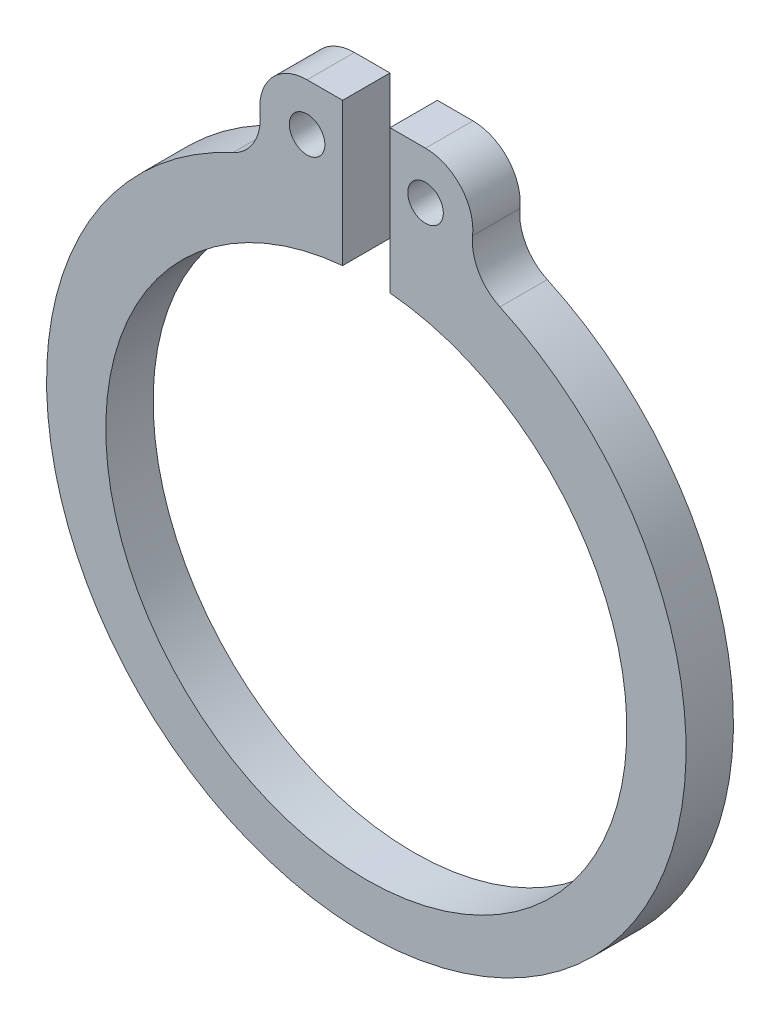
ISO-10303-21;
HEADER;
FILE_DESCRIPTION(('STEP AP214'),'2;1');
FILE_NAME('part.step','',(''),(''),'','','');
FILE_SCHEMA(('AUTOMOTIVE_DESIGN { 1 0 10303 214 1 1 1 1 }'));
ENDSEC;
DATA;
#1=APPLICATION_CONTEXT('core data for automotive mechanical design processes');
#2=APPLICATION_PROTOCOL_DEFINITION('international standard','automotive_design',2000,#1);
#3=PRODUCT_CONTEXT('',#1,'mechanical');
#4=PRODUCT('Part','Part','',(#3));
#5=PRODUCT_RELATED_PRODUCT_CATEGORY('part','',(#4));
#6=PRODUCT_DEFINITION_FORMATION('','',#4);
#7=PRODUCT_DEFINITION_CONTEXT('part definition',#1,'design');
#8=PRODUCT_DEFINITION('design','',#6,#7);
#9=PRODUCT_DEFINITION_SHAPE('','',#8);
#10=(LENGTH_UNIT() NAMED_UNIT(*) SI_UNIT(.MILLI.,.METRE.));
#11=(NAMED_UNIT(*) PLANE_ANGLE_UNIT() SI_UNIT($,.RADIAN.));
#12=(NAMED_UNIT(*) SI_UNIT($,.STERADIAN.) SOLID_ANGLE_UNIT());
#13=UNCERTAINTY_MEASURE_WITH_UNIT(LENGTH_MEASURE(1.E-05),#10,'distance_accuracy_value','');
#14=(GEOMETRIC_REPRESENTATION_CONTEXT(3) GLOBAL_UNCERTAINTY_ASSIGNED_CONTEXT((#13)) GLOBAL_UNIT_ASSIGNED_CONTEXT((#10,
#11,#12)) REPRESENTATION_CONTEXT('',''));
#15=CARTESIAN_POINT('',(0.,0.,0.));
#16=DIRECTION('',(0.,0.,1.));
#17=DIRECTION('',(1.,0.,0.));
#18=AXIS2_PLACEMENT_3D('',#15,#16,#17);
#19=CARTESIAN_POINT('',(-6.47695199813288,14.0818710693531,1.));
#20=DIRECTION('',(0.,0.,-1.));
#21=DIRECTION('',(-1.,0.,0.));
#22=AXIS2_PLACEMENT_3D('',#19,#20,#21);
#23=PLANE('',#22);
#24=CARTESIAN_POINT('',(-6.47695199813288,14.0818710693531,1.));
#25=DIRECTION('',(0.,0.,-1.));
#26=DIRECTION('',(-1.,0.,0.));
#27=AXIS2_PLACEMENT_3D('',#24,#25,#26);
#28=CIRCLE('',#27,2.);
#29=CARTESIAN_POINT('',(-4.48791519798489,14.290994496202,1.));
#30=VERTEX_POINT('',#29);
#31=CARTESIAN_POINT('',(-5.64121625643831,12.264855447501,1.));
#32=VERTEX_POINT('',#31);
#33=EDGE_CURVE('E186',#30,#32,#28,.T.);
#34=ORIENTED_EDGE('',*,*,#33,.T.);
#35=CARTESIAN_POINT('',(0.,0.,1.));
#36=DIRECTION('',(0.,0.,1.));
#37=DIRECTION('',(1.,0.,0.));
#38=AXIS2_PLACEMENT_3D('',#35,#36,#37);
#39=CIRCLE('',#38,13.5);
#40=CARTESIAN_POINT('',(5.64121625643832,12.264855447501,1.));
#41=VERTEX_POINT('',#40);
#42=EDGE_CURVE('E110',#32,#41,#39,.T.);
#43=ORIENTED_EDGE('',*,*,#42,.T.);
#44=CARTESIAN_POINT('',(6.47695199813288,14.0818710693531,1.));
#45=DIRECTION('',(0.,0.,-1.));
#46=DIRECTION('',(1.,0.,0.));
#47=AXIS2_PLACEMENT_3D('',#44,#45,#46);
#48=CIRCLE('',#47,2.);
#49=CARTESIAN_POINT('',(4.48791519798489,14.290994496202,1.));
#50=VERTEX_POINT('',#49);
#51=EDGE_CURVE('E215',#41,#50,#48,.T.);
#52=ORIENTED_EDGE('',*,*,#51,.T.);
#53=CARTESIAN_POINT('',(2.5,14.5,1.));
#54=DIRECTION('',(0.,0.,1.));
#55=DIRECTION('',(1.,0.,0.));
#56=AXIS2_PLACEMENT_3D('',#53,#54,#55);
#57=CIRCLE('',#56,1.99887221577498);
#58=CARTESIAN_POINT('',(2.5,16.498872215775,1.));
#59=VERTEX_POINT('',#58);
#60=EDGE_CURVE('E235',#50,#59,#57,.T.);
#61=ORIENTED_EDGE('',*,*,#60,.T.);
#62=DIRECTION('',(-1.,0.,0.));
#63=VECTOR('',#62,1.);
#64=CARTESIAN_POINT('',(2.5,16.498872215775,1.));
#65=LINE('',#64,#63);
#66=CARTESIAN_POINT('',(1.,16.498872215775,1.));
#67=VERTEX_POINT('',#66);
#68=EDGE_CURVE('E231',#59,#67,#65,.T.);
#69=ORIENTED_EDGE('',*,*,#68,.T.);
#70=DIRECTION('',(0.,-1.,0.));
#71=VECTOR('',#70,1.);
#72=CARTESIAN_POINT('',(1.,16.498872215775,1.));
#73=LINE('',#72,#71);
#74=CARTESIAN_POINT('',(0.999999999999995,10.4544511501033,1.));
#75=VERTEX_POINT('',#74);
#76=EDGE_CURVE('E234',#67,#75,#73,.T.);
#77=ORIENTED_EDGE('',*,*,#76,.T.);
#78=CARTESIAN_POINT('',(0.,-0.5,1.));
#79=DIRECTION('',(0.,0.,-1.));
#80=DIRECTION('',(1.,0.,0.));
#81=AXIS2_PLACEMENT_3D('',#78,#79,#80);
#82=CIRCLE('',#81,11.);
#83=CARTESIAN_POINT('',(-0.999999999999999,10.4544511501033,1.));
#84=VERTEX_POINT('',#83);
#85=EDGE_CURVE('E135',#75,#84,#82,.T.);
#86=ORIENTED_EDGE('',*,*,#85,.T.);
#87=DIRECTION('',(0.,1.,0.));
#88=VECTOR('',#87,1.);
#89=CARTESIAN_POINT('',(-1.,16.498872215775,1.));
#90=LINE('',#89,#88);
#91=CARTESIAN_POINT('',(-1.,16.498872215775,1.));
#92=VERTEX_POINT('',#91);
#93=EDGE_CURVE('E129',#84,#92,#90,.T.);
#94=ORIENTED_EDGE('',*,*,#93,.T.);
#95=DIRECTION('',(-1.,0.,0.));
#96=VECTOR('',#95,1.);
#97=CARTESIAN_POINT('',(-2.5,16.498872215775,1.));
#98=LINE('',#97,#96);
#99=CARTESIAN_POINT('',(-2.5,16.498872215775,1.));
#100=VERTEX_POINT('',#99);
#101=EDGE_CURVE('E133',#92,#100,#98,.T.);
#102=ORIENTED_EDGE('',*,*,#101,.T.);
#103=CARTESIAN_POINT('',(-2.5,14.5,1.));
#104=DIRECTION('',(0.,0.,1.));
#105=DIRECTION('',(-1.,0.,0.));
#106=AXIS2_PLACEMENT_3D('',#103,#104,#105);
#107=CIRCLE('',#106,1.99887221577498);
#108=EDGE_CURVE('E61',#100,#30,#107,.T.);
#109=ORIENTED_EDGE('',*,*,#108,.T.);
#110=EDGE_LOOP('',(#34,#43,#52,#61,#69,#77,#86,#94,#102,#109));
#111=FACE_BOUND('',#110,.T.);
#112=CARTESIAN_POINT('',(-2.5,14.5,1.));
#113=DIRECTION('',(0.,0.,1.));
#114=DIRECTION('',(1.,0.,0.));
#115=AXIS2_PLACEMENT_3D('',#112,#113,#114);
#116=CIRCLE('',#115,0.75);
#117=CARTESIAN_POINT('',(-1.75,14.5,1.));
#118=VERTEX_POINT('',#117);
#119=EDGE_CURVE('E162',#118,#118,#116,.T.);
#120=ORIENTED_EDGE('',*,*,#119,.F.);
#121=EDGE_LOOP('',(#120));
#122=FACE_BOUND('',#121,.T.);
#123=CARTESIAN_POINT('',(2.5,14.5,1.));
#124=DIRECTION('',(0.,0.,1.));
#125=DIRECTION('',(-1.,0.,0.));
#126=AXIS2_PLACEMENT_3D('',#123,#124,#125);
#127=CIRCLE('',#126,0.75);
#128=CARTESIAN_POINT('',(1.75,14.5,1.));
#129=VERTEX_POINT('',#128);
#130=EDGE_CURVE('E253',#129,#129,#127,.T.);
#131=ORIENTED_EDGE('',*,*,#130,.F.);
#132=EDGE_LOOP('',(#131));
#133=FACE_BOUND('',#132,.T.);
#134=ADVANCED_FACE('F43',(#111,#122,#133),#23,.F.);
#135=CARTESIAN_POINT('',(-6.47695199813288,14.0818710693531,-1.));
#136=DIRECTION('',(0.,0.,-1.));
#137=DIRECTION('',(-1.,0.,0.));
#138=AXIS2_PLACEMENT_3D('',#135,#136,#137);
#139=PLANE('',#138);
#140=CARTESIAN_POINT('',(-2.5,14.5,-1.));
#141=DIRECTION('',(0.,0.,1.));
#142=DIRECTION('',(1.,0.,0.));
#143=AXIS2_PLACEMENT_3D('',#140,#141,#142);
#144=CIRCLE('',#143,0.75);
#145=CARTESIAN_POINT('',(-1.75,14.5,-1.));
#146=VERTEX_POINT('',#145);
#147=EDGE_CURVE('E249',#146,#146,#144,.T.);
#148=ORIENTED_EDGE('',*,*,#147,.T.);
#149=EDGE_LOOP('',(#148));
#150=FACE_BOUND('',#149,.T.);
#151=CARTESIAN_POINT('',(-6.47695199813288,14.0818710693531,-1.));
#152=DIRECTION('',(0.,0.,-1.));
#153=DIRECTION('',(-1.,0.,0.));
#154=AXIS2_PLACEMENT_3D('',#151,#152,#153);
#155=CIRCLE('',#154,2.);
#156=CARTESIAN_POINT('',(-4.48791519798489,14.290994496202,-1.));
#157=VERTEX_POINT('',#156);
#158=CARTESIAN_POINT('',(-5.64121625643831,12.264855447501,-1.));
#159=VERTEX_POINT('',#158);
#160=EDGE_CURVE('E157',#157,#159,#155,.T.);
#161=ORIENTED_EDGE('',*,*,#160,.F.);
#162=CARTESIAN_POINT('',(-2.5,14.5,-1.));
#163=DIRECTION('',(0.,0.,1.));
#164=DIRECTION('',(-1.,0.,0.));
#165=AXIS2_PLACEMENT_3D('',#162,#163,#164);
#166=CIRCLE('',#165,1.99887221577498);
#167=CARTESIAN_POINT('',(-2.5,16.498872215775,-1.));
#168=VERTEX_POINT('',#167);
#169=EDGE_CURVE('E102',#168,#157,#166,.T.);
#170=ORIENTED_EDGE('',*,*,#169,.F.);
#171=DIRECTION('',(-1.,0.,0.));
#172=VECTOR('',#171,1.);
#173=CARTESIAN_POINT('',(-2.5,16.498872215775,-1.));
#174=LINE('',#173,#172);
#175=CARTESIAN_POINT('',(-1.,16.498872215775,-1.));
#176=VERTEX_POINT('',#175);
#177=EDGE_CURVE('E96',#176,#168,#174,.T.);
#178=ORIENTED_EDGE('',*,*,#177,.F.);
#179=DIRECTION('',(0.,1.,0.));
#180=VECTOR('',#179,1.);
#181=CARTESIAN_POINT('',(-1.,16.498872215775,-1.));
#182=LINE('',#181,#180);
#183=CARTESIAN_POINT('',(-0.999999999999999,10.4544511501033,-1.));
#184=VERTEX_POINT('',#183);
#185=EDGE_CURVE('E144',#184,#176,#182,.T.);
#186=ORIENTED_EDGE('',*,*,#185,.F.);
#187=CARTESIAN_POINT('',(0.,-0.5,-1.));
#188=DIRECTION('',(0.,0.,-1.));
#189=DIRECTION('',(1.,0.,0.));
#190=AXIS2_PLACEMENT_3D('',#187,#188,#189);
#191=CIRCLE('',#190,11.);
#192=CARTESIAN_POINT('',(0.999999999999995,10.4544511501033,-1.));
#193=VERTEX_POINT('',#192);
#194=EDGE_CURVE('E177',#193,#184,#191,.T.);
#195=ORIENTED_EDGE('',*,*,#194,.F.);
#196=DIRECTION('',(0.,-1.,0.));
#197=VECTOR('',#196,1.);
#198=CARTESIAN_POINT('',(1.,16.498872215775,-1.));
#199=LINE('',#198,#197);
#200=CARTESIAN_POINT('',(1.,16.498872215775,-1.));
#201=VERTEX_POINT('',#200);
#202=EDGE_CURVE('E174',#201,#193,#199,.T.);
#203=ORIENTED_EDGE('',*,*,#202,.F.);
#204=DIRECTION('',(-1.,0.,0.));
#205=VECTOR('',#204,1.);
#206=CARTESIAN_POINT('',(2.5,16.498872215775,-1.));
#207=LINE('',#206,#205);
#208=CARTESIAN_POINT('',(2.5,16.498872215775,-1.));
#209=VERTEX_POINT('',#208);
#210=EDGE_CURVE('E171',#209,#201,#207,.T.);
#211=ORIENTED_EDGE('',*,*,#210,.F.);
#212=CARTESIAN_POINT('',(2.5,14.5,-1.));
#213=DIRECTION('',(0.,0.,1.));
#214=DIRECTION('',(1.,0.,0.));
#215=AXIS2_PLACEMENT_3D('',#212,#213,#214);
#216=CIRCLE('',#215,1.99887221577498);
#217=CARTESIAN_POINT('',(4.48791519798489,14.290994496202,-1.));
#218=VERTEX_POINT('',#217);
#219=EDGE_CURVE('E168',#218,#209,#216,.T.);
#220=ORIENTED_EDGE('',*,*,#219,.F.);
#221=CARTESIAN_POINT('',(6.47695199813288,14.0818710693531,-1.));
#222=DIRECTION('',(0.,0.,-1.));
#223=DIRECTION('',(1.,0.,0.));
#224=AXIS2_PLACEMENT_3D('',#221,#222,#223);
#225=CIRCLE('',#224,2.);
#226=CARTESIAN_POINT('',(5.64121625643832,12.264855447501,-1.));
#227=VERTEX_POINT('',#226);
#228=EDGE_CURVE('E165',#227,#218,#225,.T.);
#229=ORIENTED_EDGE('',*,*,#228,.F.);
#230=CARTESIAN_POINT('',(0.,0.,-1.));
#231=DIRECTION('',(0.,0.,1.));
#232=DIRECTION('',(1.,0.,0.));
#233=AXIS2_PLACEMENT_3D('',#230,#231,#232);
#234=CIRCLE('',#233,13.5);
#235=EDGE_CURVE('E161',#159,#227,#234,.T.);
#236=ORIENTED_EDGE('',*,*,#235,.F.);
#237=EDGE_LOOP('',(#161,#170,#178,#186,#195,#203,#211,#220,#229,#236));
#238=FACE_BOUND('',#237,.T.);
#239=CARTESIAN_POINT('',(2.5,14.5,-1.));
#240=DIRECTION('',(0.,0.,1.));
#241=DIRECTION('',(-1.,0.,0.));
#242=AXIS2_PLACEMENT_3D('',#239,#240,#241);
#243=CIRCLE('',#242,0.75);
#244=CARTESIAN_POINT('',(1.75,14.5,-1.));
#245=VERTEX_POINT('',#244);
#246=EDGE_CURVE('E257',#245,#245,#243,.T.);
#247=ORIENTED_EDGE('',*,*,#246,.T.);
#248=EDGE_LOOP('',(#247));
#249=FACE_BOUND('',#248,.T.);
#250=ADVANCED_FACE('F219',(#150,#238,#249),#139,.T.);
#251=CARTESIAN_POINT('',(-6.47695199813288,14.0818710693531,1.));
#252=DIRECTION('',(0.,0.,-1.));
#253=DIRECTION('',(-1.,0.,0.));
#254=AXIS2_PLACEMENT_3D('',#251,#252,#253);
#255=CYLINDRICAL_SURFACE('',#254,2.);
#256=ORIENTED_EDGE('',*,*,#160,.T.);
#257=DIRECTION('',(0.,0.,-1.));
#258=VECTOR('',#257,1.);
#259=CARTESIAN_POINT('',(-5.64121625643831,12.264855447501,1.));
#260=LINE('',#259,#258);
#261=EDGE_CURVE('E11',#32,#159,#260,.T.);
#262=ORIENTED_EDGE('',*,*,#261,.F.);
#263=ORIENTED_EDGE('',*,*,#33,.F.);
#264=DIRECTION('',(0.,0.,-1.));
#265=VECTOR('',#264,1.);
#266=CARTESIAN_POINT('',(-4.48791519798489,14.290994496202,1.));
#267=LINE('',#266,#265);
#268=EDGE_CURVE('E153',#30,#157,#267,.T.);
#269=ORIENTED_EDGE('',*,*,#268,.T.);
#270=EDGE_LOOP('',(#256,#262,#263,#269));
#271=FACE_BOUND('',#270,.T.);
#272=ADVANCED_FACE('F45',(#271),#255,.F.);
#273=CARTESIAN_POINT('',(0.,0.,1.));
#274=DIRECTION('',(0.,0.,-1.));
#275=DIRECTION('',(-1.,0.,0.));
#276=AXIS2_PLACEMENT_3D('',#273,#274,#275);
#277=CYLINDRICAL_SURFACE('',#276,13.5);
#278=ORIENTED_EDGE('',*,*,#235,.T.);
#279=DIRECTION('',(0.,0.,-1.));
#280=VECTOR('',#279,1.);
#281=CARTESIAN_POINT('',(5.64121625643832,12.264855447501,1.));
#282=LINE('',#281,#280);
#283=EDGE_CURVE('E53',#41,#227,#282,.T.);
#284=ORIENTED_EDGE('',*,*,#283,.F.);
#285=ORIENTED_EDGE('',*,*,#42,.F.);
#286=ORIENTED_EDGE('',*,*,#261,.T.);
#287=EDGE_LOOP('',(#278,#284,#285,#286));
#288=FACE_BOUND('',#287,.T.);
#289=ADVANCED_FACE('F299',(#288),#277,.T.);
#290=CARTESIAN_POINT('',(6.47695199813288,14.0818710693531,1.));
#291=DIRECTION('',(0.,0.,-1.));
#292=DIRECTION('',(-1.,0.,0.));
#293=AXIS2_PLACEMENT_3D('',#290,#291,#292);
#294=CYLINDRICAL_SURFACE('',#293,2.);
#295=ORIENTED_EDGE('',*,*,#228,.T.);
#296=DIRECTION('',(0.,0.,-1.));
#297=VECTOR('',#296,1.);
#298=CARTESIAN_POINT('',(4.48791519798489,14.290994496202,1.));
#299=LINE('',#298,#297);
#300=EDGE_CURVE('E205',#50,#218,#299,.T.);
#301=ORIENTED_EDGE('',*,*,#300,.F.);
#302=ORIENTED_EDGE('',*,*,#51,.F.);
#303=ORIENTED_EDGE('',*,*,#283,.T.);
#304=EDGE_LOOP('',(#295,#301,#302,#303));
#305=FACE_BOUND('',#304,.T.);
#306=ADVANCED_FACE('F213',(#305),#294,.F.);
#307=CARTESIAN_POINT('',(2.5,14.5,1.));
#308=DIRECTION('',(0.,0.,-1.));
#309=DIRECTION('',(-1.,0.,0.));
#310=AXIS2_PLACEMENT_3D('',#307,#308,#309);
#311=CYLINDRICAL_SURFACE('',#310,1.99887221577498);
#312=ORIENTED_EDGE('',*,*,#219,.T.);
#313=DIRECTION('',(0.,0.,-1.));
#314=VECTOR('',#313,1.);
#315=CARTESIAN_POINT('',(2.5,16.498872215775,1.));
#316=LINE('',#315,#314);
#317=EDGE_CURVE('E201',#59,#209,#316,.T.);
#318=ORIENTED_EDGE('',*,*,#317,.F.);
#319=ORIENTED_EDGE('',*,*,#60,.F.);
#320=ORIENTED_EDGE('',*,*,#300,.T.);
#321=EDGE_LOOP('',(#312,#318,#319,#320));
#322=FACE_BOUND('',#321,.T.);
#323=ADVANCED_FACE('F225',(#322),#311,.T.);
#324=CARTESIAN_POINT('',(2.5,16.498872215775,1.));
#325=DIRECTION('',(0.,-1.,0.));
#326=DIRECTION('',(0.,0.,-1.));
#327=AXIS2_PLACEMENT_3D('',#324,#325,#326);
#328=PLANE('',#327);
#329=ORIENTED_EDGE('',*,*,#210,.T.);
#330=DIRECTION('',(0.,0.,-1.));
#331=VECTOR('',#330,1.);
#332=CARTESIAN_POINT('',(1.,16.498872215775,1.));
#333=LINE('',#332,#331);
#334=EDGE_CURVE('E197',#67,#201,#333,.T.);
#335=ORIENTED_EDGE('',*,*,#334,.F.);
#336=ORIENTED_EDGE('',*,*,#68,.F.);
#337=ORIENTED_EDGE('',*,*,#317,.T.);
#338=EDGE_LOOP('',(#329,#335,#336,#337));
#339=FACE_BOUND('',#338,.T.);
#340=ADVANCED_FACE('F229',(#339),#328,.F.);
#341=CARTESIAN_POINT('',(1.,16.498872215775,1.));
#342=DIRECTION('',(1.,0.,0.));
#343=DIRECTION('',(0.,0.,-1.));
#344=AXIS2_PLACEMENT_3D('',#341,#342,#343);
#345=PLANE('',#344);
#346=ORIENTED_EDGE('',*,*,#202,.T.);
#347=DIRECTION('',(0.,0.,-1.));
#348=VECTOR('',#347,1.);
#349=CARTESIAN_POINT('',(0.999999999999995,10.4544511501033,1.));
#350=LINE('',#349,#348);
#351=EDGE_CURVE('E193',#75,#193,#350,.T.);
#352=ORIENTED_EDGE('',*,*,#351,.F.);
#353=ORIENTED_EDGE('',*,*,#76,.F.);
#354=ORIENTED_EDGE('',*,*,#334,.T.);
#355=EDGE_LOOP('',(#346,#352,#353,#354));
#356=FACE_BOUND('',#355,.T.);
#357=ADVANCED_FACE('F289',(#356),#345,.F.);
#358=CARTESIAN_POINT('',(0.,-0.5,1.));
#359=DIRECTION('',(0.,0.,-1.));
#360=DIRECTION('',(-1.,0.,0.));
#361=AXIS2_PLACEMENT_3D('',#358,#359,#360);
#362=CYLINDRICAL_SURFACE('',#361,11.);
#363=ORIENTED_EDGE('',*,*,#194,.T.);
#364=DIRECTION('',(0.,0.,-1.));
#365=VECTOR('',#364,1.);
#366=CARTESIAN_POINT('',(-0.999999999999999,10.4544511501033,1.));
#367=LINE('',#366,#365);
#368=EDGE_CURVE('E146',#84,#184,#367,.T.);
#369=ORIENTED_EDGE('',*,*,#368,.F.);
#370=ORIENTED_EDGE('',*,*,#85,.F.);
#371=ORIENTED_EDGE('',*,*,#351,.T.);
#372=EDGE_LOOP('',(#363,#369,#370,#371));
#373=FACE_BOUND('',#372,.T.);
#374=ADVANCED_FACE('F286',(#373),#362,.F.);
#375=CARTESIAN_POINT('',(-1.,16.498872215775,1.));
#376=DIRECTION('',(-1.,0.,0.));
#377=DIRECTION('',(0.,-1.,0.));
#378=AXIS2_PLACEMENT_3D('',#375,#376,#377);
#379=PLANE('',#378);
#380=ORIENTED_EDGE('',*,*,#185,.T.);
#381=DIRECTION('',(0.,0.,-1.));
#382=VECTOR('',#381,1.);
#383=CARTESIAN_POINT('',(-1.,16.498872215775,1.));
#384=LINE('',#383,#382);
#385=EDGE_CURVE('E141',#92,#176,#384,.T.);
#386=ORIENTED_EDGE('',*,*,#385,.F.);
#387=ORIENTED_EDGE('',*,*,#93,.F.);
#388=ORIENTED_EDGE('',*,*,#368,.T.);
#389=EDGE_LOOP('',(#380,#386,#387,#388));
#390=FACE_BOUND('',#389,.T.);
#391=ADVANCED_FACE('F142',(#390),#379,.F.);
#392=CARTESIAN_POINT('',(-2.5,16.498872215775,1.));
#393=DIRECTION('',(0.,-1.,0.));
#394=DIRECTION('',(0.,0.,-1.));
#395=AXIS2_PLACEMENT_3D('',#392,#393,#394);
#396=PLANE('',#395);
#397=ORIENTED_EDGE('',*,*,#177,.T.);
#398=DIRECTION('',(0.,0.,-1.));
#399=VECTOR('',#398,1.);
#400=CARTESIAN_POINT('',(-2.5,16.498872215775,1.));
#401=LINE('',#400,#399);
#402=EDGE_CURVE('E147',#100,#168,#401,.T.);
#403=ORIENTED_EDGE('',*,*,#402,.F.);
#404=ORIENTED_EDGE('',*,*,#101,.F.);
#405=ORIENTED_EDGE('',*,*,#385,.T.);
#406=EDGE_LOOP('',(#397,#403,#404,#405));
#407=FACE_BOUND('',#406,.T.);
#408=ADVANCED_FACE('F149',(#407),#396,.F.);
#409=CARTESIAN_POINT('',(-2.5,14.5,1.));
#410=DIRECTION('',(0.,0.,-1.));
#411=DIRECTION('',(-1.,0.,0.));
#412=AXIS2_PLACEMENT_3D('',#409,#410,#411);
#413=CYLINDRICAL_SURFACE('',#412,1.99887221577498);
#414=ORIENTED_EDGE('',*,*,#169,.T.);
#415=ORIENTED_EDGE('',*,*,#268,.F.);
#416=ORIENTED_EDGE('',*,*,#108,.F.);
#417=ORIENTED_EDGE('',*,*,#402,.T.);
#418=EDGE_LOOP('',(#414,#415,#416,#417));
#419=FACE_BOUND('',#418,.T.);
#420=ADVANCED_FACE('F279',(#419),#413,.T.);
#421=CARTESIAN_POINT('',(-2.5,14.5,1.));
#422=DIRECTION('',(0.,0.,-1.));
#423=DIRECTION('',(-1.,0.,0.));
#424=AXIS2_PLACEMENT_3D('',#421,#422,#423);
#425=CYLINDRICAL_SURFACE('',#424,0.75);
#426=ORIENTED_EDGE('',*,*,#119,.T.);
#427=EDGE_LOOP('',(#426));
#428=FACE_BOUND('',#427,.T.);
#429=ORIENTED_EDGE('',*,*,#147,.F.);
#430=EDGE_LOOP('',(#429));
#431=FACE_BOUND('',#430,.T.);
#432=ADVANCED_FACE('F276',(#428,#431),#425,.F.);
#433=CARTESIAN_POINT('',(2.5,14.5,1.));
#434=DIRECTION('',(0.,0.,-1.));
#435=DIRECTION('',(-1.,0.,0.));
#436=AXIS2_PLACEMENT_3D('',#433,#434,#435);
#437=CYLINDRICAL_SURFACE('',#436,0.75);
#438=ORIENTED_EDGE('',*,*,#130,.T.);
#439=EDGE_LOOP('',(#438));
#440=FACE_BOUND('',#439,.T.);
#441=ORIENTED_EDGE('',*,*,#246,.F.);
#442=EDGE_LOOP('',(#441));
#443=FACE_BOUND('',#442,.T.);
#444=ADVANCED_FACE('F265',(#440,#443),#437,.F.);
#445=CLOSED_SHELL('',(#134,#250,#272,#289,#306,#323,#340,#357,#374,#391,#408,#420,#432,#444));
#446=MANIFOLD_SOLID_BREP('B2',#445);
#447=ADVANCED_BREP_SHAPE_REPRESENTATION('',(#18,#446),#14);
#448=SHAPE_DEFINITION_REPRESENTATION(#9,#447);
ENDSEC;
END-ISO-10303-21;
